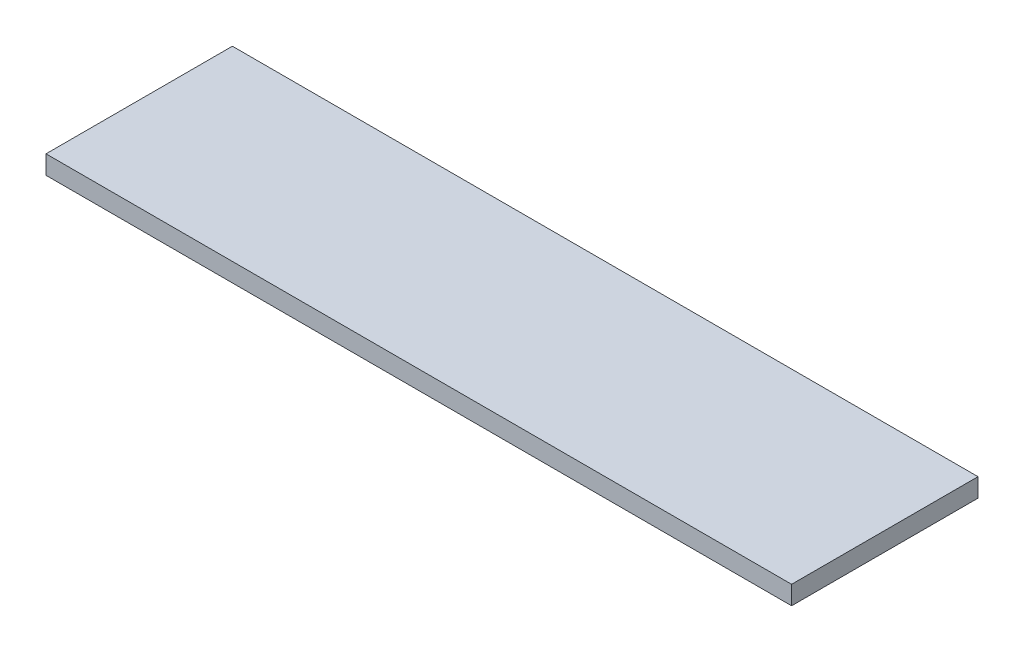
ISO-10303-21;
HEADER;
FILE_DESCRIPTION(('STEP AP214'),'2;1');
FILE_NAME('part.step','',(''),(''),'','','');
FILE_SCHEMA(('AUTOMOTIVE_DESIGN { 1 0 10303 214 1 1 1 1 }'));
ENDSEC;
DATA;
#1=APPLICATION_CONTEXT('core data for automotive mechanical design processes');
#2=APPLICATION_PROTOCOL_DEFINITION('international standard','automotive_design',2000,#1);
#3=PRODUCT_CONTEXT('',#1,'mechanical');
#4=PRODUCT('Part','Part','',(#3));
#5=PRODUCT_RELATED_PRODUCT_CATEGORY('part','',(#4));
#6=PRODUCT_DEFINITION_FORMATION('','',#4);
#7=PRODUCT_DEFINITION_CONTEXT('part definition',#1,'design');
#8=PRODUCT_DEFINITION('design','',#6,#7);
#9=PRODUCT_DEFINITION_SHAPE('','',#8);
#10=(LENGTH_UNIT() NAMED_UNIT(*) SI_UNIT(.MILLI.,.METRE.));
#11=(NAMED_UNIT(*) PLANE_ANGLE_UNIT() SI_UNIT($,.RADIAN.));
#12=(NAMED_UNIT(*) SI_UNIT($,.STERADIAN.) SOLID_ANGLE_UNIT());
#13=UNCERTAINTY_MEASURE_WITH_UNIT(LENGTH_MEASURE(1.E-05),#10,'distance_accuracy_value','');
#14=(GEOMETRIC_REPRESENTATION_CONTEXT(3) GLOBAL_UNCERTAINTY_ASSIGNED_CONTEXT((#13)) GLOBAL_UNIT_ASSIGNED_CONTEXT((#10,
#11,#12)) REPRESENTATION_CONTEXT('',''));
#15=CARTESIAN_POINT('',(0.,0.,0.));
#16=DIRECTION('',(0.,0.,1.));
#17=DIRECTION('',(1.,0.,0.));
#18=AXIS2_PLACEMENT_3D('',#15,#16,#17);
#19=CARTESIAN_POINT('',(0.,5.,0.));
#20=DIRECTION('',(1.,0.,0.));
#21=DIRECTION('',(0.,0.,-1.));
#22=AXIS2_PLACEMENT_3D('',#19,#20,#21);
#23=PLANE('',#22);
#24=DIRECTION('',(0.,0.,1.));
#25=VECTOR('',#24,1.);
#26=CARTESIAN_POINT('',(0.,0.,0.));
#27=LINE('',#26,#25);
#28=CARTESIAN_POINT('',(0.,0.,-50.));
#29=VERTEX_POINT('',#28);
#30=CARTESIAN_POINT('',(0.,0.,0.));
#31=VERTEX_POINT('',#30);
#32=EDGE_CURVE('E94',#29,#31,#27,.T.);
#33=ORIENTED_EDGE('',*,*,#32,.T.);
#34=DIRECTION('',(0.,-1.,0.));
#35=VECTOR('',#34,1.);
#36=CARTESIAN_POINT('',(0.,5.,0.));
#37=LINE('',#36,#35);
#38=CARTESIAN_POINT('',(0.,5.,0.));
#39=VERTEX_POINT('',#38);
#40=EDGE_CURVE('E11',#39,#31,#37,.T.);
#41=ORIENTED_EDGE('',*,*,#40,.F.);
#42=DIRECTION('',(0.,0.,1.));
#43=VECTOR('',#42,1.);
#44=CARTESIAN_POINT('',(0.,5.,0.));
#45=LINE('',#44,#43);
#46=CARTESIAN_POINT('',(0.,5.,-50.));
#47=VERTEX_POINT('',#46);
#48=EDGE_CURVE('E82',#47,#39,#45,.T.);
#49=ORIENTED_EDGE('',*,*,#48,.F.);
#50=DIRECTION('',(0.,-1.,0.));
#51=VECTOR('',#50,1.);
#52=CARTESIAN_POINT('',(0.,5.,-50.));
#53=LINE('',#52,#51);
#54=EDGE_CURVE('E90',#47,#29,#53,.T.);
#55=ORIENTED_EDGE('',*,*,#54,.T.);
#56=EDGE_LOOP('',(#33,#41,#49,#55));
#57=FACE_BOUND('',#56,.T.);
#58=ADVANCED_FACE('F31',(#57),#23,.F.);
#59=CARTESIAN_POINT('',(0.,5.,0.));
#60=DIRECTION('',(0.,0.,-1.));
#61=DIRECTION('',(-1.,0.,0.));
#62=AXIS2_PLACEMENT_3D('',#59,#60,#61);
#63=PLANE('',#62);
#64=DIRECTION('',(1.,0.,0.));
#65=VECTOR('',#64,1.);
#66=CARTESIAN_POINT('',(0.,0.,0.));
#67=LINE('',#66,#65);
#68=CARTESIAN_POINT('',(200.,0.,0.));
#69=VERTEX_POINT('',#68);
#70=EDGE_CURVE('E86',#31,#69,#67,.T.);
#71=ORIENTED_EDGE('',*,*,#70,.T.);
#72=DIRECTION('',(0.,-1.,0.));
#73=VECTOR('',#72,1.);
#74=CARTESIAN_POINT('',(200.,5.,0.));
#75=LINE('',#74,#73);
#76=CARTESIAN_POINT('',(200.,5.,0.));
#77=VERTEX_POINT('',#76);
#78=EDGE_CURVE('E39',#77,#69,#75,.T.);
#79=ORIENTED_EDGE('',*,*,#78,.F.);
#80=DIRECTION('',(1.,0.,0.));
#81=VECTOR('',#80,1.);
#82=CARTESIAN_POINT('',(0.,5.,0.));
#83=LINE('',#82,#81);
#84=EDGE_CURVE('E77',#39,#77,#83,.T.);
#85=ORIENTED_EDGE('',*,*,#84,.F.);
#86=ORIENTED_EDGE('',*,*,#40,.T.);
#87=EDGE_LOOP('',(#71,#79,#85,#86));
#88=FACE_BOUND('',#87,.T.);
#89=ADVANCED_FACE('F85',(#88),#63,.F.);
#90=CARTESIAN_POINT('',(200.,5.,0.));
#91=DIRECTION('',(-1.,0.,0.));
#92=DIRECTION('',(0.,0.,1.));
#93=AXIS2_PLACEMENT_3D('',#90,#91,#92);
#94=PLANE('',#93);
#95=DIRECTION('',(0.,0.,-1.));
#96=VECTOR('',#95,1.);
#97=CARTESIAN_POINT('',(200.,0.,0.));
#98=LINE('',#97,#96);
#99=CARTESIAN_POINT('',(200.,0.,-50.));
#100=VERTEX_POINT('',#99);
#101=EDGE_CURVE('E64',#69,#100,#98,.T.);
#102=ORIENTED_EDGE('',*,*,#101,.T.);
#103=DIRECTION('',(0.,-1.,0.));
#104=VECTOR('',#103,1.);
#105=CARTESIAN_POINT('',(200.,5.,-50.));
#106=LINE('',#105,#104);
#107=CARTESIAN_POINT('',(200.,5.,-50.));
#108=VERTEX_POINT('',#107);
#109=EDGE_CURVE('E87',#108,#100,#106,.T.);
#110=ORIENTED_EDGE('',*,*,#109,.F.);
#111=DIRECTION('',(0.,0.,-1.));
#112=VECTOR('',#111,1.);
#113=CARTESIAN_POINT('',(200.,5.,0.));
#114=LINE('',#113,#112);
#115=EDGE_CURVE('E80',#77,#108,#114,.T.);
#116=ORIENTED_EDGE('',*,*,#115,.F.);
#117=ORIENTED_EDGE('',*,*,#78,.T.);
#118=EDGE_LOOP('',(#102,#110,#116,#117));
#119=FACE_BOUND('',#118,.T.);
#120=ADVANCED_FACE('F88',(#119),#94,.F.);
#121=CARTESIAN_POINT('',(0.,5.,-50.));
#122=DIRECTION('',(0.,0.,1.));
#123=DIRECTION('',(1.,0.,0.));
#124=AXIS2_PLACEMENT_3D('',#121,#122,#123);
#125=PLANE('',#124);
#126=DIRECTION('',(-1.,0.,0.));
#127=VECTOR('',#126,1.);
#128=CARTESIAN_POINT('',(0.,0.,-50.));
#129=LINE('',#128,#127);
#130=EDGE_CURVE('E70',#100,#29,#129,.T.);
#131=ORIENTED_EDGE('',*,*,#130,.T.);
#132=ORIENTED_EDGE('',*,*,#54,.F.);
#133=DIRECTION('',(-1.,0.,0.));
#134=VECTOR('',#133,1.);
#135=CARTESIAN_POINT('',(0.,5.,-50.));
#136=LINE('',#135,#134);
#137=EDGE_CURVE('E47',#108,#47,#136,.T.);
#138=ORIENTED_EDGE('',*,*,#137,.F.);
#139=ORIENTED_EDGE('',*,*,#109,.T.);
#140=EDGE_LOOP('',(#131,#132,#138,#139));
#141=FACE_BOUND('',#140,.T.);
#142=ADVANCED_FACE('F101',(#141),#125,.F.);
#143=CARTESIAN_POINT('',(0.,5.,-50.));
#144=DIRECTION('',(0.,-1.,0.));
#145=DIRECTION('',(0.,0.,-1.));
#146=AXIS2_PLACEMENT_3D('',#143,#144,#145);
#147=PLANE('',#146);
#148=ORIENTED_EDGE('',*,*,#48,.T.);
#149=ORIENTED_EDGE('',*,*,#84,.T.);
#150=ORIENTED_EDGE('',*,*,#115,.T.);
#151=ORIENTED_EDGE('',*,*,#137,.T.);
#152=EDGE_LOOP('',(#148,#149,#150,#151));
#153=FACE_BOUND('',#152,.T.);
#154=ADVANCED_FACE('F78',(#153),#147,.F.);
#155=CARTESIAN_POINT('',(0.,0.,-50.));
#156=DIRECTION('',(0.,-1.,0.));
#157=DIRECTION('',(0.,0.,-1.));
#158=AXIS2_PLACEMENT_3D('',#155,#156,#157);
#159=PLANE('',#158);
#160=ORIENTED_EDGE('',*,*,#32,.F.);
#161=ORIENTED_EDGE('',*,*,#130,.F.);
#162=ORIENTED_EDGE('',*,*,#101,.F.);
#163=ORIENTED_EDGE('',*,*,#70,.F.);
#164=EDGE_LOOP('',(#160,#161,#162,#163));
#165=FACE_BOUND('',#164,.T.);
#166=ADVANCED_FACE('F104',(#165),#159,.T.);
#167=CLOSED_SHELL('',(#58,#89,#120,#142,#154,#166));
#168=MANIFOLD_SOLID_BREP('B2',#167);
#169=ADVANCED_BREP_SHAPE_REPRESENTATION('',(#18,#168),#14);
#170=SHAPE_DEFINITION_REPRESENTATION(#9,#169);
ENDSEC;
END-ISO-10303-21;
